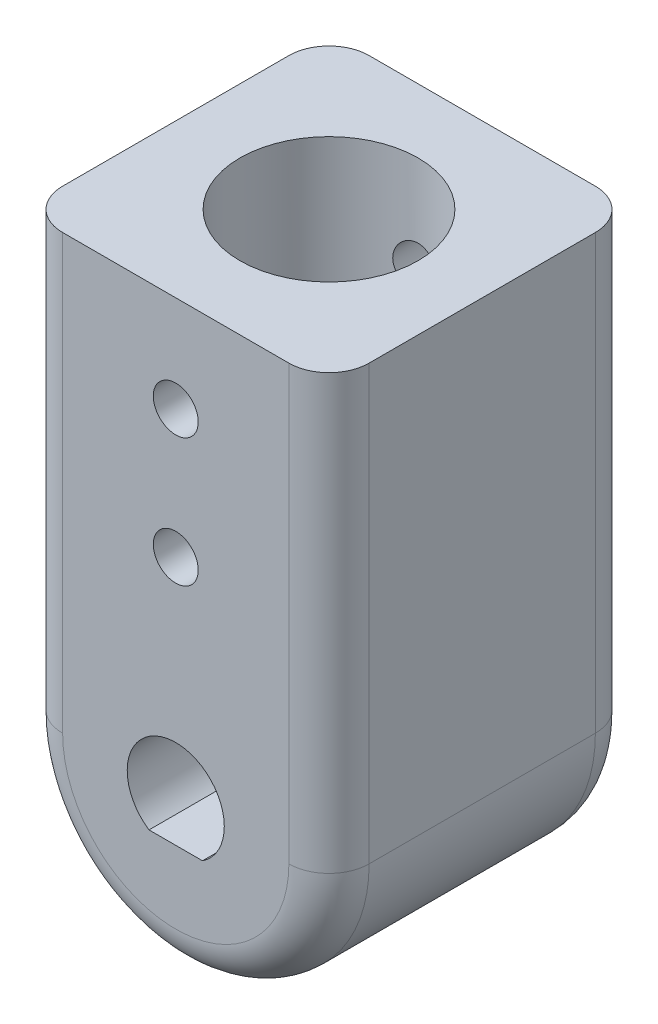
ISO-10303-21;
HEADER;
FILE_DESCRIPTION(('STEP AP214'),'2;1');
FILE_NAME('part.step','',(''),(''),'','','');
FILE_SCHEMA(('AUTOMOTIVE_DESIGN { 1 0 10303 214 1 1 1 1 }'));
ENDSEC;
DATA;
#1=APPLICATION_CONTEXT('core data for automotive mechanical design processes');
#2=APPLICATION_PROTOCOL_DEFINITION('international standard','automotive_design',2000,#1);
#3=PRODUCT_CONTEXT('',#1,'mechanical');
#4=PRODUCT('Part','Part','',(#3));
#5=PRODUCT_RELATED_PRODUCT_CATEGORY('part','',(#4));
#6=PRODUCT_DEFINITION_FORMATION('','',#4);
#7=PRODUCT_DEFINITION_CONTEXT('part definition',#1,'design');
#8=PRODUCT_DEFINITION('design','',#6,#7);
#9=PRODUCT_DEFINITION_SHAPE('','',#8);
#10=(LENGTH_UNIT() NAMED_UNIT(*) SI_UNIT(.MILLI.,.METRE.));
#11=(NAMED_UNIT(*) PLANE_ANGLE_UNIT() SI_UNIT($,.RADIAN.));
#12=(NAMED_UNIT(*) SI_UNIT($,.STERADIAN.) SOLID_ANGLE_UNIT());
#13=UNCERTAINTY_MEASURE_WITH_UNIT(LENGTH_MEASURE(1.E-05),#10,'distance_accuracy_value','');
#14=(GEOMETRIC_REPRESENTATION_CONTEXT(3) GLOBAL_UNCERTAINTY_ASSIGNED_CONTEXT((#13)) GLOBAL_UNIT_ASSIGNED_CONTEXT((#10,
#11,#12)) REPRESENTATION_CONTEXT('',''));
#15=CARTESIAN_POINT('',(0.,0.,0.));
#16=DIRECTION('',(0.,0.,1.));
#17=DIRECTION('',(1.,0.,0.));
#18=AXIS2_PLACEMENT_3D('',#15,#16,#17);
#19=CARTESIAN_POINT('',(0.,0.,9.55));
#20=DIRECTION('',(0.,0.,-1.));
#21=DIRECTION('',(-1.,0.,0.));
#22=AXIS2_PLACEMENT_3D('',#19,#20,#21);
#23=CYLINDRICAL_SURFACE('',#22,9.55);
#24=DIRECTION('',(0.,0.,-1.));
#25=VECTOR('',#24,1.);
#26=CARTESIAN_POINT('',(-9.55,0.,9.55));
#27=LINE('',#26,#25);
#28=CARTESIAN_POINT('',(-9.55,0.,-7.05));
#29=VERTEX_POINT('',#28);
#30=CARTESIAN_POINT('',(-9.55,0.,7.05));
#31=VERTEX_POINT('',#30);
#32=EDGE_CURVE('E292',#29,#31,#27,.F.);
#33=ORIENTED_EDGE('',*,*,#32,.F.);
#34=CARTESIAN_POINT('',(0.,0.,-7.05));
#35=DIRECTION('',(0.,0.,1.));
#36=DIRECTION('',(1.,0.,0.));
#37=AXIS2_PLACEMENT_3D('',#34,#35,#36);
#38=CIRCLE('',#37,9.55);
#39=CARTESIAN_POINT('',(9.55,0.,-7.05));
#40=VERTEX_POINT('',#39);
#41=EDGE_CURVE('E242',#29,#40,#38,.T.);
#42=ORIENTED_EDGE('',*,*,#41,.T.);
#43=DIRECTION('',(0.,0.,-1.));
#44=VECTOR('',#43,1.);
#45=CARTESIAN_POINT('',(9.55,0.,9.55));
#46=LINE('',#45,#44);
#47=CARTESIAN_POINT('',(9.55,0.,7.05));
#48=VERTEX_POINT('',#47);
#49=EDGE_CURVE('E289',#40,#48,#46,.F.);
#50=ORIENTED_EDGE('',*,*,#49,.T.);
#51=CARTESIAN_POINT('',(0.,0.,7.05));
#52=DIRECTION('',(0.,0.,1.));
#53=DIRECTION('',(1.,0.,0.));
#54=AXIS2_PLACEMENT_3D('',#51,#52,#53);
#55=CIRCLE('',#54,9.55);
#56=EDGE_CURVE('E225',#48,#31,#55,.F.);
#57=ORIENTED_EDGE('',*,*,#56,.T.);
#58=EDGE_LOOP('',(#33,#42,#50,#57));
#59=FACE_BOUND('',#58,.T.);
#60=ADVANCED_FACE('F43',(#59),#23,.T.);
#61=CARTESIAN_POINT('',(0.,0.,9.55));
#62=DIRECTION('',(0.,0.,1.));
#63=DIRECTION('',(1.,0.,0.));
#64=AXIS2_PLACEMENT_3D('',#61,#62,#63);
#65=PLANE('',#64);
#66=CARTESIAN_POINT('',(0.,21.025,9.55));
#67=DIRECTION('',(0.,0.,1.));
#68=DIRECTION('',(1.,0.,0.));
#69=AXIS2_PLACEMENT_3D('',#66,#67,#68);
#70=CIRCLE('',#69,1.4);
#71=CARTESIAN_POINT('',(1.4,21.025,9.55));
#72=VERTEX_POINT('',#71);
#73=EDGE_CURVE('E344',#72,#72,#70,.T.);
#74=ORIENTED_EDGE('',*,*,#73,.F.);
#75=EDGE_LOOP('',(#74));
#76=FACE_BOUND('',#75,.T.);
#77=CARTESIAN_POINT('',(0.,13.025,9.55));
#78=DIRECTION('',(0.,0.,1.));
#79=DIRECTION('',(1.,0.,0.));
#80=AXIS2_PLACEMENT_3D('',#77,#78,#79);
#81=CIRCLE('',#80,1.4);
#82=CARTESIAN_POINT('',(1.4,13.025,9.55));
#83=VERTEX_POINT('',#82);
#84=EDGE_CURVE('E295',#83,#83,#81,.T.);
#85=ORIENTED_EDGE('',*,*,#84,.F.);
#86=EDGE_LOOP('',(#85));
#87=FACE_BOUND('',#86,.T.);
#88=CARTESIAN_POINT('',(0.,0.,9.55));
#89=DIRECTION('',(0.,0.,1.));
#90=DIRECTION('',(1.,0.,0.));
#91=AXIS2_PLACEMENT_3D('',#88,#89,#90);
#92=CIRCLE('',#91,7.05);
#93=CARTESIAN_POINT('',(-7.05,0.,9.55));
#94=VERTEX_POINT('',#93);
#95=CARTESIAN_POINT('',(7.05,0.,9.55));
#96=VERTEX_POINT('',#95);
#97=EDGE_CURVE('E60',#94,#96,#92,.T.);
#98=ORIENTED_EDGE('',*,*,#97,.T.);
#99=DIRECTION('',(0.,-1.,0.));
#100=VECTOR('',#99,1.);
#101=CARTESIAN_POINT('',(7.05,27.025,9.55));
#102=LINE('',#101,#100);
#103=CARTESIAN_POINT('',(7.05,27.025,9.55));
#104=VERTEX_POINT('',#103);
#105=EDGE_CURVE('E238',#96,#104,#102,.F.);
#106=ORIENTED_EDGE('',*,*,#105,.T.);
#107=DIRECTION('',(1.,0.,0.));
#108=VECTOR('',#107,1.);
#109=CARTESIAN_POINT('',(9.55,27.025,9.55));
#110=LINE('',#109,#108);
#111=CARTESIAN_POINT('',(-7.05,27.025,9.55));
#112=VERTEX_POINT('',#111);
#113=EDGE_CURVE('E304',#112,#104,#110,.T.);
#114=ORIENTED_EDGE('',*,*,#113,.F.);
#115=DIRECTION('',(0.,-1.,0.));
#116=VECTOR('',#115,1.);
#117=CARTESIAN_POINT('',(-7.05,0.,9.55));
#118=LINE('',#117,#116);
#119=EDGE_CURVE('E65',#112,#94,#118,.T.);
#120=ORIENTED_EDGE('',*,*,#119,.T.);
#121=EDGE_LOOP('',(#98,#106,#114,#120));
#122=FACE_BOUND('',#121,.T.);
#123=DIRECTION('',(1.,0.,0.));
#124=VECTOR('',#123,1.);
#125=CARTESIAN_POINT('',(-1.66583312489577,-2.525,9.55));
#126=LINE('',#125,#124);
#127=CARTESIAN_POINT('',(-1.66583312489577,-2.525,9.55));
#128=VERTEX_POINT('',#127);
#129=CARTESIAN_POINT('',(1.66583312489577,-2.525,9.55));
#130=VERTEX_POINT('',#129);
#131=EDGE_CURVE('E121',#128,#130,#126,.T.);
#132=ORIENTED_EDGE('',*,*,#131,.F.);
#133=CARTESIAN_POINT('',(0.,0.,9.55));
#134=DIRECTION('',(0.,0.,1.));
#135=DIRECTION('',(1.,0.,0.));
#136=AXIS2_PLACEMENT_3D('',#133,#134,#135);
#137=CIRCLE('',#136,3.025);
#138=EDGE_CURVE('E131',#130,#128,#137,.T.);
#139=ORIENTED_EDGE('',*,*,#138,.F.);
#140=EDGE_LOOP('',(#132,#139));
#141=FACE_BOUND('',#140,.T.);
#142=ADVANCED_FACE('F138',(#76,#87,#122,#141),#65,.T.);
#143=CARTESIAN_POINT('',(0.,0.,-9.55));
#144=DIRECTION('',(0.,0.,1.));
#145=DIRECTION('',(1.,0.,0.));
#146=AXIS2_PLACEMENT_3D('',#143,#144,#145);
#147=PLANE('',#146);
#148=CARTESIAN_POINT('',(0.,21.025,-9.55));
#149=DIRECTION('',(0.,0.,1.));
#150=DIRECTION('',(1.,0.,0.));
#151=AXIS2_PLACEMENT_3D('',#148,#149,#150);
#152=CIRCLE('',#151,1.4);
#153=CARTESIAN_POINT('',(1.4,21.025,-9.55));
#154=VERTEX_POINT('',#153);
#155=EDGE_CURVE('E158',#154,#154,#152,.T.);
#156=ORIENTED_EDGE('',*,*,#155,.T.);
#157=EDGE_LOOP('',(#156));
#158=FACE_BOUND('',#157,.T.);
#159=CARTESIAN_POINT('',(0.,13.025,-9.55));
#160=DIRECTION('',(0.,0.,1.));
#161=DIRECTION('',(1.,0.,0.));
#162=AXIS2_PLACEMENT_3D('',#159,#160,#161);
#163=CIRCLE('',#162,1.4);
#164=CARTESIAN_POINT('',(1.4,13.025,-9.55));
#165=VERTEX_POINT('',#164);
#166=EDGE_CURVE('E235',#165,#165,#163,.T.);
#167=ORIENTED_EDGE('',*,*,#166,.T.);
#168=EDGE_LOOP('',(#167));
#169=FACE_BOUND('',#168,.T.);
#170=DIRECTION('',(-1.,0.,0.));
#171=VECTOR('',#170,1.);
#172=CARTESIAN_POINT('',(9.55,27.025,-9.55));
#173=LINE('',#172,#171);
#174=CARTESIAN_POINT('',(7.05,27.025,-9.55));
#175=VERTEX_POINT('',#174);
#176=CARTESIAN_POINT('',(-7.05,27.025,-9.55));
#177=VERTEX_POINT('',#176);
#178=EDGE_CURVE('E143',#175,#177,#173,.T.);
#179=ORIENTED_EDGE('',*,*,#178,.F.);
#180=DIRECTION('',(0.,-1.,0.));
#181=VECTOR('',#180,1.);
#182=CARTESIAN_POINT('',(7.05,0.,-9.55));
#183=LINE('',#182,#181);
#184=CARTESIAN_POINT('',(7.05,0.,-9.55));
#185=VERTEX_POINT('',#184);
#186=EDGE_CURVE('E257',#175,#185,#183,.T.);
#187=ORIENTED_EDGE('',*,*,#186,.T.);
#188=CARTESIAN_POINT('',(0.,0.,-9.55));
#189=DIRECTION('',(0.,0.,1.));
#190=DIRECTION('',(1.,0.,0.));
#191=AXIS2_PLACEMENT_3D('',#188,#189,#190);
#192=CIRCLE('',#191,7.05);
#193=CARTESIAN_POINT('',(-7.05,0.,-9.55));
#194=VERTEX_POINT('',#193);
#195=EDGE_CURVE('E260',#185,#194,#192,.F.);
#196=ORIENTED_EDGE('',*,*,#195,.T.);
#197=DIRECTION('',(0.,-1.,0.));
#198=VECTOR('',#197,1.);
#199=CARTESIAN_POINT('',(-7.05,0.,-9.55));
#200=LINE('',#199,#198);
#201=EDGE_CURVE('E148',#194,#177,#200,.F.);
#202=ORIENTED_EDGE('',*,*,#201,.T.);
#203=EDGE_LOOP('',(#179,#187,#196,#202));
#204=FACE_BOUND('',#203,.T.);
#205=CARTESIAN_POINT('',(0.,0.,-9.55));
#206=DIRECTION('',(0.,0.,1.));
#207=DIRECTION('',(1.,0.,0.));
#208=AXIS2_PLACEMENT_3D('',#205,#206,#207);
#209=CIRCLE('',#208,3.025);
#210=CARTESIAN_POINT('',(1.66583312489577,-2.525,-9.55));
#211=VERTEX_POINT('',#210);
#212=CARTESIAN_POINT('',(-1.66583312489577,-2.525,-9.55));
#213=VERTEX_POINT('',#212);
#214=EDGE_CURVE('E136',#211,#213,#209,.T.);
#215=ORIENTED_EDGE('',*,*,#214,.T.);
#216=DIRECTION('',(1.,0.,0.));
#217=VECTOR('',#216,1.);
#218=CARTESIAN_POINT('',(-1.66583312489577,-2.525,-9.55));
#219=LINE('',#218,#217);
#220=EDGE_CURVE('E139',#213,#211,#219,.T.);
#221=ORIENTED_EDGE('',*,*,#220,.T.);
#222=EDGE_LOOP('',(#215,#221));
#223=FACE_BOUND('',#222,.T.);
#224=ADVANCED_FACE('F193',(#158,#169,#204,#223),#147,.F.);
#225=CARTESIAN_POINT('',(0.,0.,9.55));
#226=DIRECTION('',(0.,0.,-1.));
#227=DIRECTION('',(-1.,0.,0.));
#228=AXIS2_PLACEMENT_3D('',#225,#226,#227);
#229=CYLINDRICAL_SURFACE('',#228,3.025);
#230=ORIENTED_EDGE('',*,*,#214,.F.);
#231=DIRECTION('',(0.,0.,-1.));
#232=VECTOR('',#231,1.);
#233=CARTESIAN_POINT('',(1.66583312489577,-2.525,9.55));
#234=LINE('',#233,#232);
#235=EDGE_CURVE('E124',#130,#211,#234,.T.);
#236=ORIENTED_EDGE('',*,*,#235,.F.);
#237=ORIENTED_EDGE('',*,*,#138,.T.);
#238=DIRECTION('',(0.,0.,-1.));
#239=VECTOR('',#238,1.);
#240=CARTESIAN_POINT('',(-1.66583312489577,-2.525,9.55));
#241=LINE('',#240,#239);
#242=EDGE_CURVE('E127',#128,#213,#241,.T.);
#243=ORIENTED_EDGE('',*,*,#242,.T.);
#244=EDGE_LOOP('',(#230,#236,#237,#243));
#245=FACE_BOUND('',#244,.T.);
#246=ADVANCED_FACE('F134',(#245),#229,.F.);
#247=CARTESIAN_POINT('',(-1.66583312489577,-2.525,9.55));
#248=DIRECTION('',(0.,1.,0.));
#249=DIRECTION('',(0.,0.,1.));
#250=AXIS2_PLACEMENT_3D('',#247,#248,#249);
#251=PLANE('',#250);
#252=ORIENTED_EDGE('',*,*,#220,.F.);
#253=ORIENTED_EDGE('',*,*,#242,.F.);
#254=ORIENTED_EDGE('',*,*,#131,.T.);
#255=ORIENTED_EDGE('',*,*,#235,.T.);
#256=EDGE_LOOP('',(#252,#253,#254,#255));
#257=FACE_BOUND('',#256,.T.);
#258=ADVANCED_FACE('F123',(#257),#251,.T.);
#259=CARTESIAN_POINT('',(0.,27.025,0.));
#260=DIRECTION('',(0.,-1.,0.));
#261=DIRECTION('',(0.,0.,-1.));
#262=AXIS2_PLACEMENT_3D('',#259,#260,#261);
#263=PLANE('',#262);
#264=DIRECTION('',(0.,0.,-1.));
#265=VECTOR('',#264,1.);
#266=CARTESIAN_POINT('',(9.55,27.025,-9.55));
#267=LINE('',#266,#265);
#268=CARTESIAN_POINT('',(9.55,27.025,7.05));
#269=VERTEX_POINT('',#268);
#270=CARTESIAN_POINT('',(9.55,27.025,-7.05));
#271=VERTEX_POINT('',#270);
#272=EDGE_CURVE('E306',#269,#271,#267,.T.);
#273=ORIENTED_EDGE('',*,*,#272,.T.);
#274=CARTESIAN_POINT('',(7.05,27.025,-7.05));
#275=DIRECTION('',(0.,-1.,0.));
#276=DIRECTION('',(0.,0.,-1.));
#277=AXIS2_PLACEMENT_3D('',#274,#275,#276);
#278=CIRCLE('',#277,2.5);
#279=EDGE_CURVE('E245',#271,#175,#278,.F.);
#280=ORIENTED_EDGE('',*,*,#279,.T.);
#281=ORIENTED_EDGE('',*,*,#178,.T.);
#282=CARTESIAN_POINT('',(-7.05,27.025,-7.05));
#283=DIRECTION('',(0.,-1.,0.));
#284=DIRECTION('',(0.,0.,-1.));
#285=AXIS2_PLACEMENT_3D('',#282,#283,#284);
#286=CIRCLE('',#285,2.5);
#287=CARTESIAN_POINT('',(-9.55,27.025,-7.05));
#288=VERTEX_POINT('',#287);
#289=EDGE_CURVE('E249',#177,#288,#286,.F.);
#290=ORIENTED_EDGE('',*,*,#289,.T.);
#291=DIRECTION('',(0.,0.,1.));
#292=VECTOR('',#291,1.);
#293=CARTESIAN_POINT('',(-9.55,27.025,-9.55));
#294=LINE('',#293,#292);
#295=CARTESIAN_POINT('',(-9.55,27.025,7.05));
#296=VERTEX_POINT('',#295);
#297=EDGE_CURVE('E301',#288,#296,#294,.T.);
#298=ORIENTED_EDGE('',*,*,#297,.T.);
#299=CARTESIAN_POINT('',(-7.05,27.025,7.05));
#300=DIRECTION('',(0.,-1.,0.));
#301=DIRECTION('',(0.,0.,-1.));
#302=AXIS2_PLACEMENT_3D('',#299,#300,#301);
#303=CIRCLE('',#302,2.5);
#304=EDGE_CURVE('E251',#296,#112,#303,.F.);
#305=ORIENTED_EDGE('',*,*,#304,.T.);
#306=ORIENTED_EDGE('',*,*,#113,.T.);
#307=CARTESIAN_POINT('',(7.05,27.025,7.05));
#308=DIRECTION('',(0.,-1.,0.));
#309=DIRECTION('',(0.,0.,-1.));
#310=AXIS2_PLACEMENT_3D('',#307,#308,#309);
#311=CIRCLE('',#310,2.5);
#312=EDGE_CURVE('E247',#104,#269,#311,.F.);
#313=ORIENTED_EDGE('',*,*,#312,.T.);
#314=EDGE_LOOP('',(#273,#280,#281,#290,#298,#305,#306,#313));
#315=FACE_BOUND('',#314,.T.);
#316=CARTESIAN_POINT('',(0.,27.025,0.));
#317=DIRECTION('',(0.,1.,0.));
#318=DIRECTION('',(0.,0.,1.));
#319=AXIS2_PLACEMENT_3D('',#316,#317,#318);
#320=CIRCLE('',#319,5.55);
#321=CARTESIAN_POINT('',(0.,27.025,5.55));
#322=VERTEX_POINT('',#321);
#323=EDGE_CURVE('E287',#322,#322,#320,.T.);
#324=ORIENTED_EDGE('',*,*,#323,.F.);
#325=EDGE_LOOP('',(#324));
#326=FACE_BOUND('',#325,.T.);
#327=ADVANCED_FACE('F314',(#315,#326),#263,.F.);
#328=CARTESIAN_POINT('',(-9.55,27.025,-9.55));
#329=DIRECTION('',(1.,0.,0.));
#330=DIRECTION('',(0.,0.,-1.));
#331=AXIS2_PLACEMENT_3D('',#328,#329,#330);
#332=PLANE('',#331);
#333=ORIENTED_EDGE('',*,*,#297,.F.);
#334=DIRECTION('',(0.,-1.,0.));
#335=VECTOR('',#334,1.);
#336=CARTESIAN_POINT('',(-9.55,27.025,-7.05));
#337=LINE('',#336,#335);
#338=EDGE_CURVE('E11',#288,#29,#337,.T.);
#339=ORIENTED_EDGE('',*,*,#338,.T.);
#340=ORIENTED_EDGE('',*,*,#32,.T.);
#341=DIRECTION('',(0.,-1.,0.));
#342=VECTOR('',#341,1.);
#343=CARTESIAN_POINT('',(-9.55,27.025,7.05));
#344=LINE('',#343,#342);
#345=EDGE_CURVE('E52',#31,#296,#344,.F.);
#346=ORIENTED_EDGE('',*,*,#345,.T.);
#347=EDGE_LOOP('',(#333,#339,#340,#346));
#348=FACE_BOUND('',#347,.T.);
#349=ADVANCED_FACE('F324',(#348),#332,.F.);
#350=CARTESIAN_POINT('',(9.55,27.025,-9.55));
#351=DIRECTION('',(-1.,0.,0.));
#352=DIRECTION('',(0.,0.,1.));
#353=AXIS2_PLACEMENT_3D('',#350,#351,#352);
#354=PLANE('',#353);
#355=ORIENTED_EDGE('',*,*,#49,.F.);
#356=DIRECTION('',(0.,-1.,0.));
#357=VECTOR('',#356,1.);
#358=CARTESIAN_POINT('',(9.55,27.025,-7.05));
#359=LINE('',#358,#357);
#360=EDGE_CURVE('E253',#40,#271,#359,.F.);
#361=ORIENTED_EDGE('',*,*,#360,.T.);
#362=ORIENTED_EDGE('',*,*,#272,.F.);
#363=DIRECTION('',(0.,-1.,0.));
#364=VECTOR('',#363,1.);
#365=CARTESIAN_POINT('',(9.55,0.,7.05));
#366=LINE('',#365,#364);
#367=EDGE_CURVE('E255',#269,#48,#366,.T.);
#368=ORIENTED_EDGE('',*,*,#367,.T.);
#369=EDGE_LOOP('',(#355,#361,#362,#368));
#370=FACE_BOUND('',#369,.T.);
#371=ADVANCED_FACE('F183',(#370),#354,.F.);
#372=CARTESIAN_POINT('',(0.,27.025,0.));
#373=DIRECTION('',(0.,-1.,0.));
#374=DIRECTION('',(0.,0.,-1.));
#375=AXIS2_PLACEMENT_3D('',#372,#373,#374);
#376=CYLINDRICAL_SURFACE('',#375,5.55);
#377=CARTESIAN_POINT('',(0.,22.425,-5.55));
#378=CARTESIAN_POINT('',(-0.0773282524604672,22.424997871376,-5.54999870808832));
#379=CARTESIAN_POINT('',(-0.154680148684055,22.4185716796651,-5.54836780053658));
#380=CARTESIAN_POINT('',(-0.307165532062602,22.3930761207744,-5.54201986535222));
#381=CARTESIAN_POINT('',(-0.382297762713886,22.3739997306038,-5.53730112347069));
#382=CARTESIAN_POINT('',(-0.528119897247396,22.3238559477171,-5.52529982226198));
#383=CARTESIAN_POINT('',(-0.598815067522937,22.292803095375,-5.51802037277527));
#384=CARTESIAN_POINT('',(-0.733992886005397,22.2196393829772,-5.50167213472218));
#385=CARTESIAN_POINT('',(-0.798475297106267,22.1775281011118,-5.49260327790442));
#386=CARTESIAN_POINT('',(-0.920747394905207,22.0825115825495,-5.47344773619476));
#387=CARTESIAN_POINT('',(-0.978388462845397,22.0294182983876,-5.46334512106987));
#388=CARTESIAN_POINT('',(-1.08404975009639,21.9143474257761,-5.44336605236748));
#389=CARTESIAN_POINT('',(-1.1320688638332,21.8523688177941,-5.43348962489456));
#390=CARTESIAN_POINT('',(-1.21782549630018,21.7201284234513,-5.41492026451434));
#391=CARTESIAN_POINT('',(-1.25539614320453,21.6497553264786,-5.40624753904901));
#392=CARTESIAN_POINT('',(-1.31811599774628,21.5034378847263,-5.39130011161042));
#393=CARTESIAN_POINT('',(-1.34326723082968,21.4274944507187,-5.38502501865205));
#394=CARTESIAN_POINT('',(-1.37992609672151,21.2738278607574,-5.37574717048073));
#395=CARTESIAN_POINT('',(-1.39170124657535,21.1961724822505,-5.37268035360679));
#396=CARTESIAN_POINT('',(-1.40210706692472,21.0399326173891,-5.36997458541724));
#397=CARTESIAN_POINT('',(-1.40073991714195,20.9613482872655,-5.37033506566568));
#398=CARTESIAN_POINT('',(-1.38511324710393,20.807536466867,-5.37438560998405));
#399=CARTESIAN_POINT('',(-1.37117314736325,20.7322740120429,-5.37799317598753));
#400=CARTESIAN_POINT('',(-1.33130610104013,20.5851920896714,-5.38799985408242));
#401=CARTESIAN_POINT('',(-1.3053782867505,20.5133728717713,-5.39439916824716));
#402=CARTESIAN_POINT('',(-1.24200117768,20.3743627473723,-5.40934360260535));
#403=CARTESIAN_POINT('',(-1.20443647852585,20.3072268450239,-5.41791005107588));
#404=CARTESIAN_POINT('',(-1.11893260777383,20.1800972162088,-5.43621156649103));
#405=CARTESIAN_POINT('',(-1.07099159059475,20.1201047632561,-5.44594684119129));
#406=CARTESIAN_POINT('',(-0.964444201268149,20.0071352378555,-5.46583592642432));
#407=CARTESIAN_POINT('',(-0.90556844994613,19.9544126008624,-5.4759936796481));
#408=CARTESIAN_POINT('',(-0.779689061980782,19.8595401906696,-5.49532835186509));
#409=CARTESIAN_POINT('',(-0.712685168237807,19.817390752038,-5.50450523981545));
#410=CARTESIAN_POINT('',(-0.572084381868508,19.744765348115,-5.52089122559794));
#411=CARTESIAN_POINT('',(-0.498464940539428,19.7143313313042,-5.52809322612011));
#412=CARTESIAN_POINT('',(-0.346932550717127,19.6663423336613,-5.53966639749279));
#413=CARTESIAN_POINT('',(-0.269020442004823,19.6487848433257,-5.54403811991613));
#414=CARTESIAN_POINT('',(-0.113289212570589,19.6274373028609,-5.54937630109324));
#415=CARTESIAN_POINT('',(-0.0355204443846344,19.6233008382729,-5.55042842297166));
#416=CARTESIAN_POINT('',(0.119598330093963,19.6279617840275,-5.54925314495587));
#417=CARTESIAN_POINT('',(0.196948374157105,19.6367580076018,-5.54702604597939));
#418=CARTESIAN_POINT('',(0.347825949000291,19.6667492737339,-5.53959752012894));
#419=CARTESIAN_POINT('',(0.421393599976704,19.6877547743229,-5.53444158886167));
#420=CARTESIAN_POINT('',(0.563956743046066,19.7413513510898,-5.52173698709125));
#421=CARTESIAN_POINT('',(0.632951767761456,19.773943609414,-5.51418807245098));
#422=CARTESIAN_POINT('',(0.765785168347844,19.8504560801917,-5.49733028674515));
#423=CARTESIAN_POINT('',(0.829508408490718,19.8945695849698,-5.48799218978042));
#424=CARTESIAN_POINT('',(0.948770591851326,19.9926258011906,-5.46863702728033));
#425=CARTESIAN_POINT('',(1.00430809257228,20.0465702413107,-5.45861984252861));
#426=CARTESIAN_POINT('',(1.1070541195942,20.1643666084026,-5.43872623616719));
#427=CARTESIAN_POINT('',(1.15401944718955,20.228432678232,-5.42885960959826));
#428=CARTESIAN_POINT('',(1.23653303999084,20.3637405809853,-5.41066338770007));
#429=CARTESIAN_POINT('',(1.27208180965975,20.4349820966652,-5.402333724464));
#430=CARTESIAN_POINT('',(1.33048770984637,20.5822390590753,-5.38824697612143));
#431=CARTESIAN_POINT('',(1.35341997355242,20.6582231767351,-5.38247470237204));
#432=CARTESIAN_POINT('',(1.38613757229052,20.8131366462987,-5.37414300385779));
#433=CARTESIAN_POINT('',(1.39592584484275,20.8920653360729,-5.37158286122957));
#434=CARTESIAN_POINT('',(1.40192203800746,21.0481507251642,-5.37002071186264));
#435=CARTESIAN_POINT('',(1.39851893958751,21.1252916982971,-5.37091678590788));
#436=CARTESIAN_POINT('',(1.37912082655477,21.277861709676,-5.37593007030188));
#437=CARTESIAN_POINT('',(1.36312607392419,21.3532907835062,-5.380047213633));
#438=CARTESIAN_POINT('',(1.31921289985264,21.4998641405332,-5.39098141496152));
#439=CARTESIAN_POINT('',(1.29136868383767,21.5710319969917,-5.39778165151252));
#440=CARTESIAN_POINT('',(1.22460550802923,21.7077372516623,-5.41331791652365));
#441=CARTESIAN_POINT('',(1.18568498479467,21.773273853311,-5.42205421822438));
#442=CARTESIAN_POINT('',(1.09665987888019,21.8987329191539,-5.44076783857651));
#443=CARTESIAN_POINT('',(1.04628597668176,21.9584603126639,-5.45077193246481));
#444=CARTESIAN_POINT('',(0.936307215925335,22.0687407982835,-5.47073548317428));
#445=CARTESIAN_POINT('',(0.876700162272594,22.1192917025459,-5.48069492879988));
#446=CARTESIAN_POINT('',(0.748613989630864,22.210698644518,-5.49966732063153));
#447=CARTESIAN_POINT('',(0.679990932774904,22.2513576700698,-5.50865930748686));
#448=CARTESIAN_POINT('',(0.53666245136437,22.3204977091886,-5.52446149175994));
#449=CARTESIAN_POINT('',(0.461961370712021,22.3489873306593,-5.53127323049613));
#450=CARTESIAN_POINT('',(0.322843262159049,22.3888179181806,-5.54095687055001));
#451=CARTESIAN_POINT('',(0.259081013071698,22.402356588545,-5.5443245659633));
#452=CARTESIAN_POINT('',(0.130218028128103,22.4204481749816,-5.54884658825243));
#453=CARTESIAN_POINT('',(0.0651173971569376,22.4250017924943,-5.55000108790673));
#454=CARTESIAN_POINT('',(0.,22.425,-5.55));
#455=B_SPLINE_CURVE_WITH_KNOTS('',3,(#377,#378,#379,#380,#381,#382,#383,#384,#385,#386,#387,
#388,#389,#390,#391,#392,#393,#394,#395,#396,#397,#398,#399,#400,#401,#402,#403,#404,#405,#406,
#407,#408,#409,#410,#411,#412,#413,#414,#415,#416,#417,#418,#419,#420,#421,#422,#423,#424,#425,
#426,#427,#428,#429,#430,#431,#432,#433,#434,#435,#436,#437,#438,#439,#440,#441,#442,#443,#444,
#445,#446,#447,#448,#449,#450,#451,#452,#453,#454),.UNSPECIFIED.,.T.,.F.,(4,2,2,2,2,2,2,2,2,2,2,
2,2,2,2,2,2,2,2,2,2,2,2,2,2,2,2,2,2,2,2,2,2,2,2,2,2,2,4),(0.,0.231746103700521,
0.463620973353906,0.695215210247168,0.926818282290713,1.16277561594482,1.39876004585034,
1.63832133269582,1.87784353727476,2.11248604659873,2.34708963986072,2.57589590172634,
2.80471872787777,3.03588768007903,3.26709778292643,3.5050247785989,3.74295930205584,
3.98173802529584,4.2204702006262,4.45298921272767,4.68548688904951,4.91446808284282,
5.14347264529494,5.37659814069808,5.60976466864925,5.84876588935855,6.08775654787777,
6.32530813531517,6.56280662405711,6.79335590563316,7.02390039052323,7.25302189313935,
7.48217575273041,7.71740907119022,7.95269840023112,8.19234782515088,8.43182745465877,
8.62699391486013,8.82214513830144),.UNSPECIFIED.);
#456=CARTESIAN_POINT('',(0.,22.425,-5.55));
#457=VERTEX_POINT('',#456);
#458=EDGE_CURVE('E263',#457,#457,#455,.T.);
#459=ORIENTED_EDGE('',*,*,#458,.F.);
#460=EDGE_LOOP('',(#459));
#461=FACE_BOUND('',#460,.T.);
#462=CARTESIAN_POINT('',(1.4,21.025,5.37052138995834));
#463=CARTESIAN_POINT('',(1.39999784563169,20.947715887296,5.37052285112954));
#464=CARTESIAN_POINT('',(1.39357873624353,20.870408076818,5.37220783714485));
#465=CARTESIAN_POINT('',(1.3681138539132,20.7180141460234,5.37874812177519));
#466=CARTESIAN_POINT('',(1.34906086701656,20.6429293206364,5.38360523165165));
#467=CARTESIAN_POINT('',(1.29898547368023,20.4972077295951,5.39590545258252));
#468=CARTESIAN_POINT('',(1.26797869932674,20.4265652943306,5.40334518505601));
#469=CARTESIAN_POINT('',(1.19492369316398,20.2914768214687,5.41996816185509));
#470=CARTESIAN_POINT('',(1.15287494060615,20.2270310763081,5.42915148840431));
#471=CARTESIAN_POINT('',(1.05792333144602,20.1047217415088,5.4484572420586));
#472=CARTESIAN_POINT('',(1.00481834822986,20.047017439244,5.45859489377152));
#473=CARTESIAN_POINT('',(0.889697010873595,19.941232926523,5.47853505674059));
#474=CARTESIAN_POINT('',(0.827679812995627,19.8931536283185,5.48833753615639));
#475=CARTESIAN_POINT('',(0.695401501387602,19.8073305706676,5.50667151326751));
#476=CARTESIAN_POINT('',(0.625035680487297,19.7697435390888,5.51518295089454));
#477=CARTESIAN_POINT('',(0.478733817260155,19.7069914344112,5.52980201513049));
#478=CARTESIAN_POINT('',(0.402798614102907,19.6818244943071,5.53591000300129));
#479=CARTESIAN_POINT('',(0.249174359595021,19.6451378732911,5.54492633224107));
#480=CARTESIAN_POINT('',(0.171553701485959,19.6333476351103,5.54789801855487));
#481=CARTESIAN_POINT('',(0.0153830917109727,19.6228995777004,5.55052775434298));
#482=CARTESIAN_POINT('',(-0.0631667183988347,19.6242397831457,5.55018630224127));
#483=CARTESIAN_POINT('',(-0.21708853738188,19.639820514119,5.54627528968168));
#484=CARTESIAN_POINT('',(-0.292492248918029,19.6537689632625,5.54277881998977));
#485=CARTESIAN_POINT('',(-0.439852207552978,19.693700445384,5.53303589488002));
#486=CARTESIAN_POINT('',(-0.51180826906356,19.7196841254214,5.52678929160552));
#487=CARTESIAN_POINT('',(-0.65099670485106,19.7831831540591,5.51213661128808));
#488=CARTESIAN_POINT('',(-0.71817978248355,19.8208019345482,5.50371128092349));
#489=CARTESIAN_POINT('',(-0.845381537398343,19.9064247231392,5.48561426717834));
#490=CARTESIAN_POINT('',(-0.905398945221955,19.9544305671728,5.4759423635861));
#491=CARTESIAN_POINT('',(-1.01830780218693,20.0610285146131,5.45609107248857));
#492=CARTESIAN_POINT('',(-1.07095743971919,20.119875785779,5.44590504464984));
#493=CARTESIAN_POINT('',(-1.16569553605145,20.2456707521194,5.42641685402318));
#494=CARTESIAN_POINT('',(-1.20778348270344,20.3126188398781,5.41711473411049));
#495=CARTESIAN_POINT('',(-1.28036209555727,20.4531959240138,5.40042341848142));
#496=CARTESIAN_POINT('',(-1.31079356457854,20.526856730537,5.39304404640788));
#497=CARTESIAN_POINT('',(-1.35876524904697,20.6784801756888,5.38115920749539));
#498=CARTESIAN_POINT('',(-1.37630827991458,20.756441870805,5.3766531130305));
#499=CARTESIAN_POINT('',(-1.39760184917188,20.912209021456,5.37115701877968));
#500=CARTESIAN_POINT('',(-1.40171033887217,20.9899623829494,5.3700757915906));
#501=CARTESIAN_POINT('',(-1.39699899076413,21.1450440192453,5.37130336180534));
#502=CARTESIAN_POINT('',(-1.38818036708106,21.2223723332841,5.37361184084518));
#503=CARTESIAN_POINT('',(-1.3581792062322,21.373073083647,5.38127120530481));
#504=CARTESIAN_POINT('',(-1.33720596220927,21.4464900556293,5.38657055090558));
#505=CARTESIAN_POINT('',(-1.28372339627566,21.5887659000835,5.39956542561672));
#506=CARTESIAN_POINT('',(-1.2512126888588,21.6576242239393,5.40726124249995));
#507=CARTESIAN_POINT('',(-1.17483181542362,21.7903422845238,5.42437337248443));
#508=CARTESIAN_POINT('',(-1.13074814200376,21.8540750279229,5.43382092202454));
#509=CARTESIAN_POINT('',(-1.03274197348472,21.9733699137863,5.45329580003212));
#510=CARTESIAN_POINT('',(-0.978817830928358,22.0289306853102,5.46332322538807));
#511=CARTESIAN_POINT('',(-0.86101696386122,22.131759185454,5.48313783925082));
#512=CARTESIAN_POINT('',(-0.796921328701556,22.1787790287734,5.49291236217428));
#513=CARTESIAN_POINT('',(-0.661536604860899,22.2613884248109,5.51085519526239));
#514=CARTESIAN_POINT('',(-0.590247893325717,22.2969785763993,5.51902358957309));
#515=CARTESIAN_POINT('',(-0.442995291976898,22.3554066530245,5.53278209534715));
#516=CARTESIAN_POINT('',(-0.3670698435821,22.3783368704286,5.5383908136378));
#517=CARTESIAN_POINT('',(-0.212282690867613,22.4110701168447,5.54647953491231));
#518=CARTESIAN_POINT('',(-0.133421567309894,22.4208757282498,5.54896015337449));
#519=CARTESIAN_POINT('',(0.0226713267378228,22.4269339602553,5.55048753412935));
#520=CARTESIAN_POINT('',(0.0998882172604344,22.4235521053273,5.5496269104654));
#521=CARTESIAN_POINT('',(0.252615866994477,22.4041701397155,5.54477441951871));
#522=CARTESIAN_POINT('',(0.328126678562112,22.3881704167916,5.54078264845935));
#523=CARTESIAN_POINT('',(0.474908555810046,22.3442043850454,5.53013124882437));
#524=CARTESIAN_POINT('',(0.546200898216439,22.3163052409941,5.52348660729723));
#525=CARTESIAN_POINT('',(0.683133025054864,22.2493930925907,5.50822849543443));
#526=CARTESIAN_POINT('',(0.748772084328984,22.2103786652159,5.49961477303715));
#527=CARTESIAN_POINT('',(0.874263470614575,22.1212345814085,5.48108457303065));
#528=CARTESIAN_POINT('',(0.933936223552658,22.0708576599934,5.47114150536467));
#529=CARTESIAN_POINT('',(1.04410514399443,21.9608972060058,5.45119122862261));
#530=CARTESIAN_POINT('',(1.09459897046103,21.9013113318876,5.44118400385545));
#531=CARTESIAN_POINT('',(1.18592389878491,21.7732555783363,5.4220206999195));
#532=CARTESIAN_POINT('',(1.22655219599541,21.7046378511601,5.41288450984868));
#533=CARTESIAN_POINT('',(1.29563614205324,21.5613251412048,5.39676701125777));
#534=CARTESIAN_POINT('',(1.32410053175438,21.4866345684022,5.38978415638192));
#535=CARTESIAN_POINT('',(1.36387779415614,21.3475779629155,5.37983941620948));
#536=CARTESIAN_POINT('',(1.37739380047545,21.2838694745528,5.37637170715733));
#537=CARTESIAN_POINT('',(1.39545541224452,21.1551128433693,5.3717121799413));
#538=CARTESIAN_POINT('',(1.40000181374387,21.0900648199496,5.37052015981106));
#539=CARTESIAN_POINT('',(1.4,21.025,5.37052138995834));
#540=B_SPLINE_CURVE_WITH_KNOTS('',3,(#462,#463,#464,#465,#466,#467,#468,#469,#470,#471,#472,
#473,#474,#475,#476,#477,#478,#479,#480,#481,#482,#483,#484,#485,#486,#487,#488,#489,#490,#491,
#492,#493,#494,#495,#496,#497,#498,#499,#500,#501,#502,#503,#504,#505,#506,#507,#508,#509,#510,
#511,#512,#513,#514,#515,#516,#517,#518,#519,#520,#521,#522,#523,#524,#525,#526,#527,#528,#529,
#530,#531,#532,#533,#534,#535,#536,#537,#538,#539),.UNSPECIFIED.,.T.,.F.,(4,2,2,2,2,2,2,2,2,2,2,
2,2,2,2,2,2,2,2,2,2,2,2,2,2,2,2,2,2,2,2,2,2,2,2,2,2,2,4),(0.,0.231613359086823,0.46335908360806,
0.694802774341443,0.926257382105906,1.16238816387466,1.39854131537994,1.6380532602323,
1.87752919034424,2.11206994938774,2.346575424989,2.57578388805165,2.80500467565655,
3.03632475208379,3.2676857481916,3.50541936666098,3.74316451086867,3.98210151770034,
4.22098631430216,4.45345203378104,4.68589592128505,4.91445145221963,5.14303443913019,
5.3761736937958,5.60935201569417,5.84848234235604,6.08760013749758,6.32495090951994,
6.56225497361562,6.79302893228235,7.02379579930509,7.25327701940325,7.48278763181108,
7.71788039494756,7.95303303339365,8.19267355621852,8.43214158517123,8.62715215856971,
8.82214542406312),.UNSPECIFIED.);
#541=CARTESIAN_POINT('',(1.4,21.025,5.37052138995834));
#542=VERTEX_POINT('',#541);
#543=EDGE_CURVE('E269',#542,#542,#540,.T.);
#544=ORIENTED_EDGE('',*,*,#543,.F.);
#545=EDGE_LOOP('',(#544));
#546=FACE_BOUND('',#545,.T.);
#547=CARTESIAN_POINT('',(0.,14.425,-5.55));
#548=CARTESIAN_POINT('',(-0.077328252460467,14.424997871376,-5.54999870808832));
#549=CARTESIAN_POINT('',(-0.154680148684054,14.4185716796651,-5.54836780053658));
#550=CARTESIAN_POINT('',(-0.307165532062601,14.3930761207744,-5.54201986535222));
#551=CARTESIAN_POINT('',(-0.382297762713886,14.3739997306038,-5.53730112347069));
#552=CARTESIAN_POINT('',(-0.528119897247395,14.3238559477171,-5.52529982226198));
#553=CARTESIAN_POINT('',(-0.598815067522936,14.292803095375,-5.51802037277527));
#554=CARTESIAN_POINT('',(-0.733992886005395,14.2196393829772,-5.50167213472218));
#555=CARTESIAN_POINT('',(-0.798475297106266,14.1775281011118,-5.49260327790442));
#556=CARTESIAN_POINT('',(-0.920747394905206,14.0825115825495,-5.47344773619476));
#557=CARTESIAN_POINT('',(-0.978388462845396,14.0294182983876,-5.46334512106987));
#558=CARTESIAN_POINT('',(-1.08404975009639,13.9143474257761,-5.44336605236748));
#559=CARTESIAN_POINT('',(-1.1320688638332,13.8523688177941,-5.43348962489456));
#560=CARTESIAN_POINT('',(-1.21782549630017,13.7201284234513,-5.41492026451434));
#561=CARTESIAN_POINT('',(-1.25539614320453,13.6497553264786,-5.40624753904901));
#562=CARTESIAN_POINT('',(-1.31811599774628,13.5034378847263,-5.39130011161042));
#563=CARTESIAN_POINT('',(-1.34326723082967,13.4274944507187,-5.38502501865205));
#564=CARTESIAN_POINT('',(-1.37992609672151,13.2738278607574,-5.37574717048073));
#565=CARTESIAN_POINT('',(-1.39170124657535,13.1961724822505,-5.37268035360679));
#566=CARTESIAN_POINT('',(-1.40210706692472,13.0399326173891,-5.36997458541724));
#567=CARTESIAN_POINT('',(-1.40073991714195,12.9613482872655,-5.37033506566568));
#568=CARTESIAN_POINT('',(-1.38511324710393,12.8075364668669,-5.37438560998405));
#569=CARTESIAN_POINT('',(-1.37117314736324,12.7322740120429,-5.37799317598753));
#570=CARTESIAN_POINT('',(-1.33130610104012,12.5851920896714,-5.38799985408242));
#571=CARTESIAN_POINT('',(-1.30537828675049,12.5133728717713,-5.39439916824716));
#572=CARTESIAN_POINT('',(-1.24200117768,12.3743627473723,-5.40934360260535));
#573=CARTESIAN_POINT('',(-1.20443647852585,12.3072268450239,-5.41791005107588));
#574=CARTESIAN_POINT('',(-1.11893260777382,12.1800972162088,-5.43621156649103));
#575=CARTESIAN_POINT('',(-1.07099159059475,12.1201047632561,-5.44594684119129));
#576=CARTESIAN_POINT('',(-0.964444201268148,12.0071352378555,-5.46583592642432));
#577=CARTESIAN_POINT('',(-0.905568449946127,11.9544126008624,-5.4759936796481));
#578=CARTESIAN_POINT('',(-0.779689061980779,11.8595401906696,-5.49532835186509));
#579=CARTESIAN_POINT('',(-0.712685168237804,11.817390752038,-5.50450523981545));
#580=CARTESIAN_POINT('',(-0.572084381868505,11.744765348115,-5.52089122559794));
#581=CARTESIAN_POINT('',(-0.498464940539425,11.7143313313042,-5.52809322612011));
#582=CARTESIAN_POINT('',(-0.346932550717122,11.6663423336612,-5.53966639749279));
#583=CARTESIAN_POINT('',(-0.269020442004818,11.6487848433257,-5.54403811991613));
#584=CARTESIAN_POINT('',(-0.113289212570584,11.6274373028609,-5.54937630109324));
#585=CARTESIAN_POINT('',(-0.0355204443846299,11.6233008382729,-5.55042842297166));
#586=CARTESIAN_POINT('',(0.119598330093967,11.6279617840275,-5.54925314495587));
#587=CARTESIAN_POINT('',(0.196948374157108,11.6367580076018,-5.54702604597939));
#588=CARTESIAN_POINT('',(0.347825949000295,11.6667492737339,-5.53959752012894));
#589=CARTESIAN_POINT('',(0.421393599976709,11.6877547743229,-5.53444158886167));
#590=CARTESIAN_POINT('',(0.563956743046071,11.7413513510898,-5.52173698709125));
#591=CARTESIAN_POINT('',(0.632951767761459,11.773943609414,-5.51418807245098));
#592=CARTESIAN_POINT('',(0.765785168347848,11.8504560801917,-5.49733028674515));
#593=CARTESIAN_POINT('',(0.829508408490722,11.8945695849698,-5.48799218978042));
#594=CARTESIAN_POINT('',(0.948770591851331,11.9926258011906,-5.46863702728032));
#595=CARTESIAN_POINT('',(1.00430809257229,12.0465702413107,-5.45861984252861));
#596=CARTESIAN_POINT('',(1.10705411959421,12.1643666084026,-5.43872623616719));
#597=CARTESIAN_POINT('',(1.15401944718955,12.228432678232,-5.42885960959826));
#598=CARTESIAN_POINT('',(1.23653303999085,12.3637405809853,-5.41066338770007));
#599=CARTESIAN_POINT('',(1.27208180965975,12.4349820966652,-5.402333724464));
#600=CARTESIAN_POINT('',(1.33048770984638,12.5822390590753,-5.38824697612143));
#601=CARTESIAN_POINT('',(1.35341997355242,12.6582231767351,-5.38247470237204));
#602=CARTESIAN_POINT('',(1.38613757229052,12.8131366462987,-5.37414300385779));
#603=CARTESIAN_POINT('',(1.39592584484275,12.8920653360729,-5.37158286122957));
#604=CARTESIAN_POINT('',(1.40192203800746,13.0481507251642,-5.37002071186264));
#605=CARTESIAN_POINT('',(1.39851893958751,13.1252916982971,-5.37091678590788));
#606=CARTESIAN_POINT('',(1.37912082655478,13.277861709676,-5.37593007030188));
#607=CARTESIAN_POINT('',(1.36312607392419,13.3532907835062,-5.380047213633));
#608=CARTESIAN_POINT('',(1.31921289985265,13.4998641405332,-5.39098141496152));
#609=CARTESIAN_POINT('',(1.29136868383767,13.5710319969917,-5.39778165151252));
#610=CARTESIAN_POINT('',(1.22460550802923,13.7077372516623,-5.41331791652365));
#611=CARTESIAN_POINT('',(1.18568498479467,13.773273853311,-5.42205421822438));
#612=CARTESIAN_POINT('',(1.09665987888019,13.8987329191539,-5.44076783857651));
#613=CARTESIAN_POINT('',(1.04628597668177,13.9584603126639,-5.45077193246481));
#614=CARTESIAN_POINT('',(0.936307215925339,14.0687407982834,-5.47073548317428));
#615=CARTESIAN_POINT('',(0.876700162272597,14.1192917025459,-5.48069492879988));
#616=CARTESIAN_POINT('',(0.748613989630867,14.210698644518,-5.49966732063152));
#617=CARTESIAN_POINT('',(0.679990932774906,14.2513576700698,-5.50865930748686));
#618=CARTESIAN_POINT('',(0.536662451364371,14.3204977091886,-5.52446149175994));
#619=CARTESIAN_POINT('',(0.461961370712023,14.3489873306593,-5.53127323049613));
#620=CARTESIAN_POINT('',(0.322843262159051,14.3888179181806,-5.54095687055001));
#621=CARTESIAN_POINT('',(0.2590810130717,14.402356588545,-5.5443245659633));
#622=CARTESIAN_POINT('',(0.130218028128104,14.4204481749816,-5.54884658825243));
#623=CARTESIAN_POINT('',(0.0651173971569382,14.4250017924943,-5.55000108790673));
#624=CARTESIAN_POINT('',(0.,14.425,-5.55));
#625=B_SPLINE_CURVE_WITH_KNOTS('',3,(#547,#548,#549,#550,#551,#552,#553,#554,#555,#556,#557,
#558,#559,#560,#561,#562,#563,#564,#565,#566,#567,#568,#569,#570,#571,#572,#573,#574,#575,#576,
#577,#578,#579,#580,#581,#582,#583,#584,#585,#586,#587,#588,#589,#590,#591,#592,#593,#594,#595,
#596,#597,#598,#599,#600,#601,#602,#603,#604,#605,#606,#607,#608,#609,#610,#611,#612,#613,#614,
#615,#616,#617,#618,#619,#620,#621,#622,#623,#624),.UNSPECIFIED.,.T.,.F.,(4,2,2,2,2,2,2,2,2,2,2,
2,2,2,2,2,2,2,2,2,2,2,2,2,2,2,2,2,2,2,2,2,2,2,2,2,2,2,4),(0.,0.23174610370052,0.463620973353905,
0.695215210247168,0.926818282290711,1.16277561594482,1.39876004585034,1.63832133269582,
1.87784353727476,2.11248604659872,2.34708963986071,2.57589590172635,2.80471872787777,
3.03588768007902,3.26709778292643,3.5050247785989,3.74295930205584,3.98173802529584,
4.2204702006262,4.45298921272767,4.68548688904951,4.91446808284282,5.14347264529494,
5.37659814069808,5.60976466864925,5.84876588935855,6.08775654787777,6.32530813531517,
6.56280662405711,6.79335590563315,7.02390039052324,7.25302189313935,7.48217575273041,
7.71740907119022,7.95269840023112,8.19234782515089,8.43182745465877,8.62699391486013,
8.82214513830144),.UNSPECIFIED.);
#626=CARTESIAN_POINT('',(0.,14.425,-5.55));
#627=VERTEX_POINT('',#626);
#628=EDGE_CURVE('E157',#627,#627,#625,.T.);
#629=ORIENTED_EDGE('',*,*,#628,.F.);
#630=EDGE_LOOP('',(#629));
#631=FACE_BOUND('',#630,.T.);
#632=CARTESIAN_POINT('',(1.4,13.025,5.37052138995834));
#633=CARTESIAN_POINT('',(1.3999978456317,12.947715887296,5.37052285112954));
#634=CARTESIAN_POINT('',(1.39357873624353,12.870408076818,5.37220783714485));
#635=CARTESIAN_POINT('',(1.3681138539132,12.7180141460234,5.37874812177519));
#636=CARTESIAN_POINT('',(1.34906086701656,12.6429293206364,5.38360523165165));
#637=CARTESIAN_POINT('',(1.29898547368023,12.4972077295951,5.39590545258252));
#638=CARTESIAN_POINT('',(1.26797869932674,12.4265652943306,5.40334518505601));
#639=CARTESIAN_POINT('',(1.19492369316398,12.2914768214688,5.41996816185508));
#640=CARTESIAN_POINT('',(1.15287494060616,12.2270310763081,5.42915148840431));
#641=CARTESIAN_POINT('',(1.05792333144603,12.1047217415088,5.4484572420586));
#642=CARTESIAN_POINT('',(1.00481834822987,12.047017439244,5.45859489377152));
#643=CARTESIAN_POINT('',(0.889697010873596,11.941232926523,5.47853505674059));
#644=CARTESIAN_POINT('',(0.827679812995628,11.8931536283185,5.48833753615639));
#645=CARTESIAN_POINT('',(0.695401501387603,11.8073305706676,5.50667151326751));
#646=CARTESIAN_POINT('',(0.625035680487298,11.7697435390888,5.51518295089454));
#647=CARTESIAN_POINT('',(0.478733817260156,11.7069914344112,5.52980201513049));
#648=CARTESIAN_POINT('',(0.402798614102909,11.6818244943071,5.53591000300129));
#649=CARTESIAN_POINT('',(0.249174359595023,11.645137873291,5.54492633224107));
#650=CARTESIAN_POINT('',(0.171553701485961,11.6333476351103,5.54789801855487));
#651=CARTESIAN_POINT('',(0.0153830917109745,11.6228995777004,5.55052775434298));
#652=CARTESIAN_POINT('',(-0.0631667183988329,11.6242397831457,5.55018630224127));
#653=CARTESIAN_POINT('',(-0.217088537381878,11.639820514119,5.54627528968168));
#654=CARTESIAN_POINT('',(-0.292492248918026,11.6537689632625,5.54277881998977));
#655=CARTESIAN_POINT('',(-0.439852207552976,11.693700445384,5.53303589488002));
#656=CARTESIAN_POINT('',(-0.511808269063558,11.7196841254214,5.52678929160552));
#657=CARTESIAN_POINT('',(-0.650996704851058,11.7831831540591,5.51213661128808));
#658=CARTESIAN_POINT('',(-0.718179782483549,11.8208019345482,5.50371128092349));
#659=CARTESIAN_POINT('',(-0.845381537398341,11.9064247231392,5.48561426717833));
#660=CARTESIAN_POINT('',(-0.905398945221953,11.9544305671728,5.4759423635861));
#661=CARTESIAN_POINT('',(-1.01830780218693,12.0610285146131,5.45609107248857));
#662=CARTESIAN_POINT('',(-1.07095743971919,12.119875785779,5.44590504464984));
#663=CARTESIAN_POINT('',(-1.16569553605145,12.2456707521194,5.42641685402318));
#664=CARTESIAN_POINT('',(-1.20778348270343,12.3126188398781,5.41711473411049));
#665=CARTESIAN_POINT('',(-1.28036209555727,12.4531959240138,5.40042341848142));
#666=CARTESIAN_POINT('',(-1.31079356457854,12.526856730537,5.39304404640788));
#667=CARTESIAN_POINT('',(-1.35876524904697,12.6784801756888,5.38115920749539));
#668=CARTESIAN_POINT('',(-1.37630827991457,12.756441870805,5.3766531130305));
#669=CARTESIAN_POINT('',(-1.39760184917188,12.912209021456,5.37115701877968));
#670=CARTESIAN_POINT('',(-1.40171033887216,12.9899623829494,5.3700757915906));
#671=CARTESIAN_POINT('',(-1.39699899076413,13.1450440192453,5.37130336180534));
#672=CARTESIAN_POINT('',(-1.38818036708105,13.2223723332841,5.37361184084518));
#673=CARTESIAN_POINT('',(-1.3581792062322,13.373073083647,5.38127120530481));
#674=CARTESIAN_POINT('',(-1.33720596220927,13.4464900556293,5.38657055090558));
#675=CARTESIAN_POINT('',(-1.28372339627566,13.5887659000835,5.39956542561672));
#676=CARTESIAN_POINT('',(-1.2512126888588,13.6576242239393,5.40726124249995));
#677=CARTESIAN_POINT('',(-1.17483181542362,13.7903422845238,5.42437337248443));
#678=CARTESIAN_POINT('',(-1.13074814200375,13.8540750279229,5.43382092202454));
#679=CARTESIAN_POINT('',(-1.03274197348472,13.9733699137863,5.45329580003212));
#680=CARTESIAN_POINT('',(-0.978817830928357,14.0289306853102,5.46332322538807));
#681=CARTESIAN_POINT('',(-0.861016963861219,14.131759185454,5.48313783925082));
#682=CARTESIAN_POINT('',(-0.796921328701554,14.1787790287734,5.49291236217428));
#683=CARTESIAN_POINT('',(-0.661536604860896,14.2613884248109,5.51085519526239));
#684=CARTESIAN_POINT('',(-0.590247893325715,14.2969785763992,5.51902358957309));
#685=CARTESIAN_POINT('',(-0.442995291976896,14.3554066530245,5.53278209534715));
#686=CARTESIAN_POINT('',(-0.367069843582099,14.3783368704286,5.5383908136378));
#687=CARTESIAN_POINT('',(-0.212282690867611,14.4110701168447,5.54647953491231));
#688=CARTESIAN_POINT('',(-0.133421567309891,14.4208757282498,5.54896015337449));
#689=CARTESIAN_POINT('',(0.0226713267378257,14.4269339602553,5.55048753412935));
#690=CARTESIAN_POINT('',(0.0998882172604375,14.4235521053273,5.5496269104654));
#691=CARTESIAN_POINT('',(0.25261586699448,14.4041701397155,5.54477441951871));
#692=CARTESIAN_POINT('',(0.328126678562115,14.3881704167916,5.54078264845935));
#693=CARTESIAN_POINT('',(0.474908555810049,14.3442043850454,5.53013124882437));
#694=CARTESIAN_POINT('',(0.546200898216442,14.3163052409941,5.52348660729723));
#695=CARTESIAN_POINT('',(0.683133025054867,14.2493930925907,5.50822849543443));
#696=CARTESIAN_POINT('',(0.748772084328987,14.2103786652159,5.49961477303715));
#697=CARTESIAN_POINT('',(0.874263470614578,14.1212345814085,5.48108457303065));
#698=CARTESIAN_POINT('',(0.933936223552661,14.0708576599934,5.47114150536467));
#699=CARTESIAN_POINT('',(1.04410514399443,13.9608972060058,5.45119122862261));
#700=CARTESIAN_POINT('',(1.09459897046104,13.9013113318876,5.44118400385545));
#701=CARTESIAN_POINT('',(1.18592389878491,13.7732555783363,5.4220206999195));
#702=CARTESIAN_POINT('',(1.22655219599541,13.7046378511601,5.41288450984868));
#703=CARTESIAN_POINT('',(1.29563614205324,13.5613251412048,5.39676701125777));
#704=CARTESIAN_POINT('',(1.32410053175438,13.4866345684022,5.38978415638192));
#705=CARTESIAN_POINT('',(1.36387779415615,13.3475779629155,5.37983941620948));
#706=CARTESIAN_POINT('',(1.37739380047545,13.2838694745528,5.37637170715733));
#707=CARTESIAN_POINT('',(1.39545541224453,13.1551128433693,5.3717121799413));
#708=CARTESIAN_POINT('',(1.40000181374387,13.0900648199496,5.37052015981106));
#709=CARTESIAN_POINT('',(1.4,13.025,5.37052138995834));
#710=B_SPLINE_CURVE_WITH_KNOTS('',3,(#632,#633,#634,#635,#636,#637,#638,#639,#640,#641,#642,
#643,#644,#645,#646,#647,#648,#649,#650,#651,#652,#653,#654,#655,#656,#657,#658,#659,#660,#661,
#662,#663,#664,#665,#666,#667,#668,#669,#670,#671,#672,#673,#674,#675,#676,#677,#678,#679,#680,
#681,#682,#683,#684,#685,#686,#687,#688,#689,#690,#691,#692,#693,#694,#695,#696,#697,#698,#699,
#700,#701,#702,#703,#704,#705,#706,#707,#708,#709),.UNSPECIFIED.,.T.,.F.,(4,2,2,2,2,2,2,2,2,2,2,
2,2,2,2,2,2,2,2,2,2,2,2,2,2,2,2,2,2,2,2,2,2,2,2,2,2,2,4),(0.,0.231613359086821,0.46335908360806,
0.694802774341441,0.926257382105905,1.16238816387466,1.39854131537994,1.6380532602323,
1.87752919034424,2.11206994938774,2.346575424989,2.57578388805165,2.80500467565655,
3.03632475208379,3.2676857481916,3.50541936666098,3.74316451086867,3.98210151770034,
4.22098631430216,4.45345203378105,4.68589592128505,4.91445145221963,5.14303443913019,
5.3761736937958,5.60935201569417,5.84848234235604,6.08760013749758,6.32495090951994,
6.56225497361562,6.79302893228235,7.02379579930509,7.25327701940326,7.48278763181108,
7.71788039494756,7.95303303339365,8.19267355621853,8.43214158517123,8.62715215856972,
8.82214542406312),.UNSPECIFIED.);
#711=CARTESIAN_POINT('',(1.4,13.025,5.37052138995834));
#712=VERTEX_POINT('',#711);
#713=EDGE_CURVE('E149',#712,#712,#710,.T.);
#714=ORIENTED_EDGE('',*,*,#713,.F.);
#715=EDGE_LOOP('',(#714));
#716=FACE_BOUND('',#715,.T.);
#717=ORIENTED_EDGE('',*,*,#323,.T.);
#718=EDGE_LOOP('',(#717));
#719=FACE_BOUND('',#718,.T.);
#720=CARTESIAN_POINT('',(0.,7.025,0.));
#721=DIRECTION('',(0.,-1.,0.));
#722=DIRECTION('',(0.,0.,-1.));
#723=AXIS2_PLACEMENT_3D('',#720,#721,#722);
#724=CIRCLE('',#723,5.55);
#725=CARTESIAN_POINT('',(0.,7.025,-5.55));
#726=VERTEX_POINT('',#725);
#727=EDGE_CURVE('E268',#726,#726,#724,.T.);
#728=ORIENTED_EDGE('',*,*,#727,.T.);
#729=EDGE_LOOP('',(#728));
#730=FACE_BOUND('',#729,.T.);
#731=ADVANCED_FACE('F163',(#461,#546,#631,#716,#719,#730),#376,.F.);
#732=CARTESIAN_POINT('',(0.,7.025,0.));
#733=DIRECTION('',(0.,-1.,0.));
#734=DIRECTION('',(0.,0.,-1.));
#735=AXIS2_PLACEMENT_3D('',#732,#733,#734);
#736=PLANE('',#735);
#737=ORIENTED_EDGE('',*,*,#727,.F.);
#738=EDGE_LOOP('',(#737));
#739=FACE_BOUND('',#738,.T.);
#740=ADVANCED_FACE('F172',(#739),#736,.F.);
#741=CARTESIAN_POINT('',(0.,13.025,-9.55));
#742=DIRECTION('',(0.,0.,1.));
#743=DIRECTION('',(1.,0.,0.));
#744=AXIS2_PLACEMENT_3D('',#741,#742,#743);
#745=CYLINDRICAL_SURFACE('',#744,1.4);
#746=ORIENTED_EDGE('',*,*,#713,.T.);
#747=EDGE_LOOP('',(#746));
#748=FACE_BOUND('',#747,.T.);
#749=ORIENTED_EDGE('',*,*,#84,.T.);
#750=EDGE_LOOP('',(#749));
#751=FACE_BOUND('',#750,.T.);
#752=ADVANCED_FACE('F167',(#748,#751),#745,.F.);
#753=ORIENTED_EDGE('',*,*,#628,.T.);
#754=EDGE_LOOP('',(#753));
#755=FACE_BOUND('',#754,.T.);
#756=ORIENTED_EDGE('',*,*,#166,.F.);
#757=EDGE_LOOP('',(#756));
#758=FACE_BOUND('',#757,.T.);
#759=ADVANCED_FACE('F171',(#755,#758),#745,.F.);
#760=CARTESIAN_POINT('',(0.,21.025,-9.55));
#761=DIRECTION('',(0.,0.,1.));
#762=DIRECTION('',(1.,0.,0.));
#763=AXIS2_PLACEMENT_3D('',#760,#761,#762);
#764=CYLINDRICAL_SURFACE('',#763,1.4);
#765=ORIENTED_EDGE('',*,*,#543,.T.);
#766=EDGE_LOOP('',(#765));
#767=FACE_BOUND('',#766,.T.);
#768=ORIENTED_EDGE('',*,*,#73,.T.);
#769=EDGE_LOOP('',(#768));
#770=FACE_BOUND('',#769,.T.);
#771=ADVANCED_FACE('F174',(#767,#770),#764,.F.);
#772=ORIENTED_EDGE('',*,*,#458,.T.);
#773=EDGE_LOOP('',(#772));
#774=FACE_BOUND('',#773,.T.);
#775=ORIENTED_EDGE('',*,*,#155,.F.);
#776=EDGE_LOOP('',(#775));
#777=FACE_BOUND('',#776,.T.);
#778=ADVANCED_FACE('F210',(#774,#777),#764,.F.);
#779=CARTESIAN_POINT('',(-7.05,27.025,-7.05));
#780=DIRECTION('',(0.,-1.,0.));
#781=DIRECTION('',(0.,0.,-1.));
#782=AXIS2_PLACEMENT_3D('',#779,#780,#781);
#783=CYLINDRICAL_SURFACE('',#782,2.5);
#784=ORIENTED_EDGE('',*,*,#289,.F.);
#785=ORIENTED_EDGE('',*,*,#201,.F.);
#786=CARTESIAN_POINT('',(-7.05,0.,-7.05));
#787=DIRECTION('',(0.,-1.,0.));
#788=DIRECTION('',(0.,0.,-1.));
#789=AXIS2_PLACEMENT_3D('',#786,#787,#788);
#790=CIRCLE('',#789,2.5);
#791=EDGE_CURVE('E230',#29,#194,#790,.T.);
#792=ORIENTED_EDGE('',*,*,#791,.F.);
#793=ORIENTED_EDGE('',*,*,#338,.F.);
#794=EDGE_LOOP('',(#784,#785,#792,#793));
#795=FACE_BOUND('',#794,.T.);
#796=ADVANCED_FACE('F206',(#795),#783,.T.);
#797=CARTESIAN_POINT('',(0.,0.,-7.05));
#798=DIRECTION('',(0.,0.,1.));
#799=DIRECTION('',(1.,0.,0.));
#800=AXIS2_PLACEMENT_3D('',#797,#798,#799);
#801=TOROIDAL_SURFACE('',#800,7.05,2.5);
#802=ORIENTED_EDGE('',*,*,#791,.T.);
#803=ORIENTED_EDGE('',*,*,#195,.F.);
#804=CARTESIAN_POINT('',(7.05,0.,-7.05));
#805=DIRECTION('',(0.,1.,0.));
#806=DIRECTION('',(0.,0.,1.));
#807=AXIS2_PLACEMENT_3D('',#804,#805,#806);
#808=CIRCLE('',#807,2.5);
#809=EDGE_CURVE('E228',#40,#185,#808,.T.);
#810=ORIENTED_EDGE('',*,*,#809,.F.);
#811=ORIENTED_EDGE('',*,*,#41,.F.);
#812=EDGE_LOOP('',(#802,#803,#810,#811));
#813=FACE_BOUND('',#812,.T.);
#814=ADVANCED_FACE('F202',(#813),#801,.T.);
#815=CARTESIAN_POINT('',(7.05,0.,-7.05));
#816=DIRECTION('',(0.,-1.,0.));
#817=DIRECTION('',(0.,0.,-1.));
#818=AXIS2_PLACEMENT_3D('',#815,#816,#817);
#819=CYLINDRICAL_SURFACE('',#818,2.5);
#820=ORIENTED_EDGE('',*,*,#279,.F.);
#821=ORIENTED_EDGE('',*,*,#360,.F.);
#822=ORIENTED_EDGE('',*,*,#809,.T.);
#823=ORIENTED_EDGE('',*,*,#186,.F.);
#824=EDGE_LOOP('',(#820,#821,#822,#823));
#825=FACE_BOUND('',#824,.T.);
#826=ADVANCED_FACE('F199',(#825),#819,.T.);
#827=CARTESIAN_POINT('',(-7.05,0.,7.05));
#828=DIRECTION('',(0.,1.,0.));
#829=DIRECTION('',(0.,0.,1.));
#830=AXIS2_PLACEMENT_3D('',#827,#828,#829);
#831=CYLINDRICAL_SURFACE('',#830,2.5);
#832=ORIENTED_EDGE('',*,*,#304,.F.);
#833=ORIENTED_EDGE('',*,*,#345,.F.);
#834=CARTESIAN_POINT('',(-7.05,0.,7.05));
#835=DIRECTION('',(0.,-1.,0.));
#836=DIRECTION('',(0.,0.,-1.));
#837=AXIS2_PLACEMENT_3D('',#834,#835,#836);
#838=CIRCLE('',#837,2.5);
#839=EDGE_CURVE('E47',#94,#31,#838,.T.);
#840=ORIENTED_EDGE('',*,*,#839,.F.);
#841=ORIENTED_EDGE('',*,*,#119,.F.);
#842=EDGE_LOOP('',(#832,#833,#840,#841));
#843=FACE_BOUND('',#842,.T.);
#844=ADVANCED_FACE('F45',(#843),#831,.T.);
#845=CARTESIAN_POINT('',(0.,0.,7.05));
#846=DIRECTION('',(0.,0.,1.));
#847=DIRECTION('',(1.,0.,0.));
#848=AXIS2_PLACEMENT_3D('',#845,#846,#847);
#849=TOROIDAL_SURFACE('',#848,7.05,2.5);
#850=ORIENTED_EDGE('',*,*,#839,.T.);
#851=ORIENTED_EDGE('',*,*,#56,.F.);
#852=CARTESIAN_POINT('',(7.05,0.,7.05));
#853=DIRECTION('',(0.,1.,0.));
#854=DIRECTION('',(0.,0.,1.));
#855=AXIS2_PLACEMENT_3D('',#852,#853,#854);
#856=CIRCLE('',#855,2.5);
#857=EDGE_CURVE('E229',#96,#48,#856,.T.);
#858=ORIENTED_EDGE('',*,*,#857,.F.);
#859=ORIENTED_EDGE('',*,*,#97,.F.);
#860=EDGE_LOOP('',(#850,#851,#858,#859));
#861=FACE_BOUND('',#860,.T.);
#862=ADVANCED_FACE('F214',(#861),#849,.T.);
#863=CARTESIAN_POINT('',(7.05,27.025,7.05));
#864=DIRECTION('',(0.,1.,0.));
#865=DIRECTION('',(0.,0.,1.));
#866=AXIS2_PLACEMENT_3D('',#863,#864,#865);
#867=CYLINDRICAL_SURFACE('',#866,2.5);
#868=ORIENTED_EDGE('',*,*,#312,.F.);
#869=ORIENTED_EDGE('',*,*,#105,.F.);
#870=ORIENTED_EDGE('',*,*,#857,.T.);
#871=ORIENTED_EDGE('',*,*,#367,.F.);
#872=EDGE_LOOP('',(#868,#869,#870,#871));
#873=FACE_BOUND('',#872,.T.);
#874=ADVANCED_FACE('F212',(#873),#867,.T.);
#875=CLOSED_SHELL('',(#60,#142,#224,#246,#258,#327,#349,#371,#731,#740,#752,#759,#771,#778,#796,
#814,#826,#844,#862,#874));
#876=MANIFOLD_SOLID_BREP('B2',#875);
#877=ADVANCED_BREP_SHAPE_REPRESENTATION('',(#18,#876),#14);
#878=SHAPE_DEFINITION_REPRESENTATION(#9,#877);
ENDSEC;
END-ISO-10303-21;
